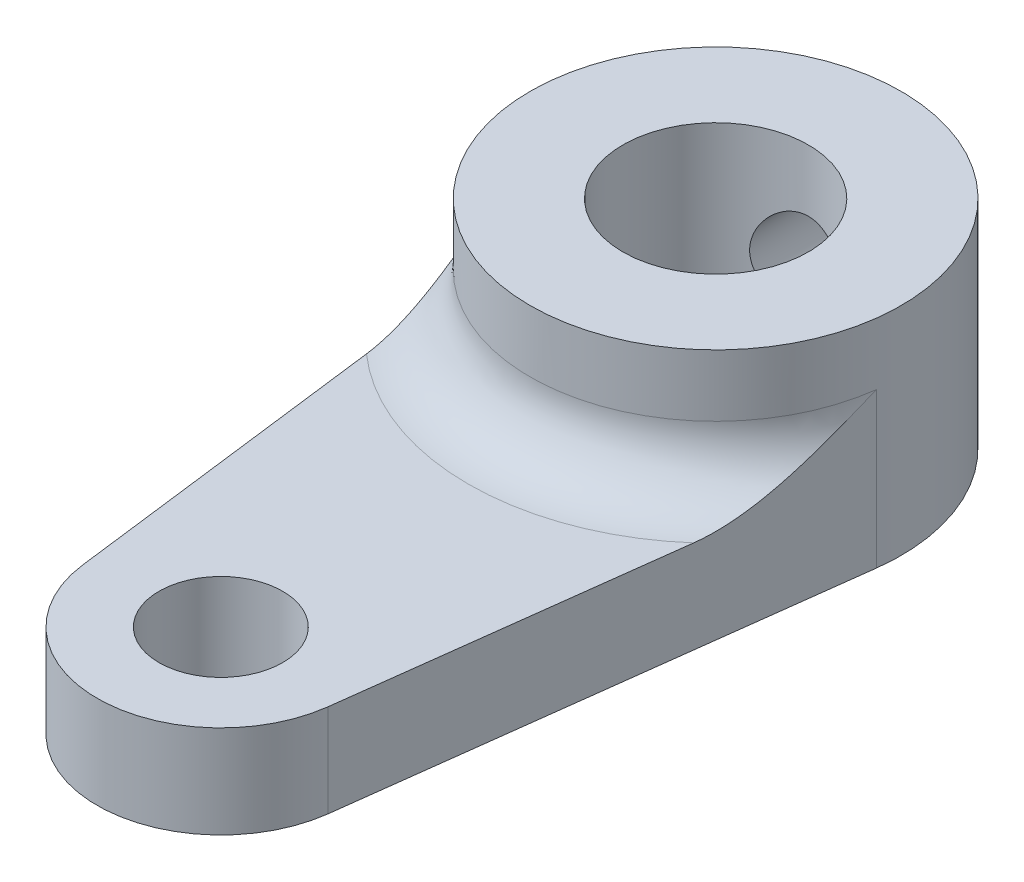
ISO-10303-21;
HEADER;
FILE_DESCRIPTION(('STEP AP214'),'2;1');
FILE_NAME('part.step','',(''),(''),'','','');
FILE_SCHEMA(('AUTOMOTIVE_DESIGN { 1 0 10303 214 1 1 1 1 }'));
ENDSEC;
DATA;
#1=APPLICATION_CONTEXT('core data for automotive mechanical design processes');
#2=APPLICATION_PROTOCOL_DEFINITION('international standard','automotive_design',2000,#1);
#3=PRODUCT_CONTEXT('',#1,'mechanical');
#4=PRODUCT('Part','Part','',(#3));
#5=PRODUCT_RELATED_PRODUCT_CATEGORY('part','',(#4));
#6=PRODUCT_DEFINITION_FORMATION('','',#4);
#7=PRODUCT_DEFINITION_CONTEXT('part definition',#1,'design');
#8=PRODUCT_DEFINITION('design','',#6,#7);
#9=PRODUCT_DEFINITION_SHAPE('','',#8);
#10=(LENGTH_UNIT() NAMED_UNIT(*) SI_UNIT(.MILLI.,.METRE.));
#11=(NAMED_UNIT(*) PLANE_ANGLE_UNIT() SI_UNIT($,.RADIAN.));
#12=(NAMED_UNIT(*) SI_UNIT($,.STERADIAN.) SOLID_ANGLE_UNIT());
#13=UNCERTAINTY_MEASURE_WITH_UNIT(LENGTH_MEASURE(1.E-05),#10,'distance_accuracy_value','');
#14=(GEOMETRIC_REPRESENTATION_CONTEXT(3) GLOBAL_UNCERTAINTY_ASSIGNED_CONTEXT((#13)) GLOBAL_UNIT_ASSIGNED_CONTEXT((#10,
#11,#12)) REPRESENTATION_CONTEXT('',''));
#15=CARTESIAN_POINT('',(0.,0.,0.));
#16=DIRECTION('',(0.,0.,1.));
#17=DIRECTION('',(1.,0.,0.));
#18=AXIS2_PLACEMENT_3D('',#15,#16,#17);
#19=CARTESIAN_POINT('',(-5.95294044989533,3.,0.750000000000001));
#20=DIRECTION('',(0.992156741649221,0.,-0.125));
#21=DIRECTION('',(-0.125,0.,-0.992156741649222));
#22=AXIS2_PLACEMENT_3D('',#19,#20,#21);
#23=PLANE('',#22);
#24=DIRECTION('',(0.125,0.,0.992156741649222));
#25=VECTOR('',#24,1.);
#26=CARTESIAN_POINT('',(-5.95294044989533,0.,0.750000000000001));
#27=LINE('',#26,#25);
#28=CARTESIAN_POINT('',(-5.95294044989533,0.,0.750000000000001));
#29=VERTEX_POINT('',#28);
#30=CARTESIAN_POINT('',(-3.96862696659688,0.,16.5));
#31=VERTEX_POINT('',#30);
#32=EDGE_CURVE('E177',#29,#31,#27,.T.);
#33=ORIENTED_EDGE('',*,*,#32,.T.);
#34=DIRECTION('',(0.,-1.,0.));
#35=VECTOR('',#34,1.);
#36=CARTESIAN_POINT('',(-3.96862696659688,3.,16.5));
#37=LINE('',#36,#35);
#38=CARTESIAN_POINT('',(-3.96862696659688,3.,16.5));
#39=VERTEX_POINT('',#38);
#40=EDGE_CURVE('E169',#39,#31,#37,.T.);
#41=ORIENTED_EDGE('',*,*,#40,.F.);
#42=DIRECTION('',(0.125,0.,0.992156741649222));
#43=VECTOR('',#42,1.);
#44=CARTESIAN_POINT('',(-5.95294044989533,3.,0.750000000000001));
#45=LINE('',#44,#43);
#46=CARTESIAN_POINT('',(-5.29150262212918,3.,6.));
#47=VERTEX_POINT('',#46);
#48=EDGE_CURVE('E153',#47,#39,#45,.T.);
#49=ORIENTED_EDGE('',*,*,#48,.F.);
#50=CARTESIAN_POINT('',(-5.29150262212918,3.,6.));
#51=CARTESIAN_POINT('',(-5.31039781985102,3.00003932371851,5.85002401756384));
#52=CARTESIAN_POINT('',(-5.32927068108454,3.00749080861605,5.7002253255075));
#53=CARTESIAN_POINT('',(-5.36682983971674,3.03529748814447,5.40210874592657));
#54=CARTESIAN_POINT('',(-5.38551644968368,3.05562506504879,5.25378837746843));
#55=CARTESIAN_POINT('',(-5.42237695613106,3.10690972129876,4.96121717768945));
#56=CARTESIAN_POINT('',(-5.44055436264542,3.13771036698746,4.81693848633806));
#57=CARTESIAN_POINT('',(-5.47663555915593,3.20848018103607,4.5305528674207));
#58=CARTESIAN_POINT('',(-5.49453918362414,3.24845467894679,4.38844725369198));
#59=CARTESIAN_POINT('',(-5.5510486235935,3.38804779430903,3.93991747903264));
#60=CARTESIAN_POINT('',(-5.589090545969,3.5022836971656,3.63796908103139));
#61=CARTESIAN_POINT('',(-5.66384180156038,3.75580816906779,3.04464938357758));
#62=CARTESIAN_POINT('',(-5.70054954085287,3.89512559194145,2.75329073549965));
#63=CARTESIAN_POINT('',(-5.8096367203732,4.33812108028087,1.88743809079078));
#64=CARTESIAN_POINT('',(-5.88048240155265,4.66533067276013,1.3251179291993));
#65=CARTESIAN_POINT('',(-5.95182241893325,4.99483605454589,0.758874095651225));
#66=CARTESIAN_POINT('',(-5.95238143594606,4.99741804396551,0.754437035667543));
#67=CARTESIAN_POINT('',(-5.95294044989533,5.,0.750000000000002));
#68=B_SPLINE_CURVE_WITH_KNOTS('',3,(#50,#51,#52,#53,#54,#55,#56,#57,#58,#59,#60,#61,#62,#63,#64,
#65,#66,#67),.UNSPECIFIED.,.F.,.F.,(4,2,2,2,2,2,2,2,4),(0.,0.453047985174248,0.905127510168364,
1.35073120961666,1.79659444088085,2.76988627914161,3.74430503334663,5.70583133706981,
5.72132327058452),.UNSPECIFIED.);
#69=CARTESIAN_POINT('',(-5.95294044989533,5.,0.750000000000001));
#70=VERTEX_POINT('',#69);
#71=EDGE_CURVE('E55',#47,#70,#68,.T.);
#72=ORIENTED_EDGE('',*,*,#71,.T.);
#73=DIRECTION('',(0.,-1.,0.));
#74=VECTOR('',#73,1.);
#75=CARTESIAN_POINT('',(-5.95294044989533,3.,0.750000000000001));
#76=LINE('',#75,#74);
#77=EDGE_CURVE('E355',#70,#29,#76,.T.);
#78=ORIENTED_EDGE('',*,*,#77,.T.);
#79=EDGE_LOOP('',(#33,#41,#49,#72,#78));
#80=FACE_BOUND('',#79,.T.);
#81=ADVANCED_FACE('F101',(#80),#23,.F.);
#82=CARTESIAN_POINT('',(0.,3.,16.));
#83=DIRECTION('',(0.,-1.,0.));
#84=DIRECTION('',(0.,0.,-1.));
#85=AXIS2_PLACEMENT_3D('',#82,#83,#84);
#86=CYLINDRICAL_SURFACE('',#85,4.);
#87=CARTESIAN_POINT('',(0.,0.,16.));
#88=DIRECTION('',(0.,1.,0.));
#89=DIRECTION('',(0.,0.,1.));
#90=AXIS2_PLACEMENT_3D('',#87,#88,#89);
#91=CIRCLE('',#90,4.);
#92=CARTESIAN_POINT('',(3.96862696659689,0.,16.5));
#93=VERTEX_POINT('',#92);
#94=EDGE_CURVE('E358',#31,#93,#91,.T.);
#95=ORIENTED_EDGE('',*,*,#94,.T.);
#96=DIRECTION('',(0.,-1.,0.));
#97=VECTOR('',#96,1.);
#98=CARTESIAN_POINT('',(3.96862696659689,3.,16.5));
#99=LINE('',#98,#97);
#100=CARTESIAN_POINT('',(3.96862696659689,3.,16.5));
#101=VERTEX_POINT('',#100);
#102=EDGE_CURVE('E171',#101,#93,#99,.T.);
#103=ORIENTED_EDGE('',*,*,#102,.F.);
#104=CARTESIAN_POINT('',(0.,3.,16.));
#105=DIRECTION('',(0.,1.,0.));
#106=DIRECTION('',(0.,0.,1.));
#107=AXIS2_PLACEMENT_3D('',#104,#105,#106);
#108=CIRCLE('',#107,4.);
#109=EDGE_CURVE('E157',#39,#101,#108,.T.);
#110=ORIENTED_EDGE('',*,*,#109,.F.);
#111=ORIENTED_EDGE('',*,*,#40,.T.);
#112=EDGE_LOOP('',(#95,#103,#110,#111));
#113=FACE_BOUND('',#112,.T.);
#114=ADVANCED_FACE('F168',(#113),#86,.T.);
#115=CARTESIAN_POINT('',(5.95294044989533,3.,0.75));
#116=DIRECTION('',(0.992156741649221,0.,0.125));
#117=DIRECTION('',(0.125,0.,-0.992156741649222));
#118=AXIS2_PLACEMENT_3D('',#115,#116,#117);
#119=PLANE('',#118);
#120=DIRECTION('',(-0.125,0.,0.992156741649222));
#121=VECTOR('',#120,1.);
#122=CARTESIAN_POINT('',(5.95294044989533,0.,0.75));
#123=LINE('',#122,#121);
#124=CARTESIAN_POINT('',(5.95294044989533,0.,0.75));
#125=VERTEX_POINT('',#124);
#126=EDGE_CURVE('E361',#125,#93,#123,.T.);
#127=ORIENTED_EDGE('',*,*,#126,.F.);
#128=DIRECTION('',(0.,-1.,0.));
#129=VECTOR('',#128,1.);
#130=CARTESIAN_POINT('',(5.95294044989533,3.,0.75));
#131=LINE('',#130,#129);
#132=CARTESIAN_POINT('',(5.95294044989533,5.,0.75));
#133=VERTEX_POINT('',#132);
#134=EDGE_CURVE('E185',#133,#125,#131,.T.);
#135=ORIENTED_EDGE('',*,*,#134,.F.);
#136=CARTESIAN_POINT('',(5.29150262212918,3.,6.));
#137=CARTESIAN_POINT('',(5.31039781985097,3.00003932371851,5.85002401756428));
#138=CARTESIAN_POINT('',(5.32927068108443,3.00749080861601,5.70022532550839));
#139=CARTESIAN_POINT('',(5.36682983971653,3.03529748814427,5.40210874592826));
#140=CARTESIAN_POINT('',(5.38551644968343,3.0556250650485,5.25378837747046));
#141=CARTESIAN_POINT('',(5.42237695613082,3.10690972129836,4.96121717769137));
#142=CARTESIAN_POINT('',(5.44055436264524,3.13771036698711,4.81693848633955));
#143=CARTESIAN_POINT('',(5.47663555915584,3.20848018103589,4.53055286742141));
#144=CARTESIAN_POINT('',(5.4945391836241,3.24845467894673,4.38844725369236));
#145=CARTESIAN_POINT('',(5.55104862359352,3.38804779430897,3.93991747903248));
#146=CARTESIAN_POINT('',(5.58909054596907,3.50228369716513,3.63796908103086));
#147=CARTESIAN_POINT('',(5.66384180156042,3.75580816906862,3.04464938357725));
#148=CARTESIAN_POINT('',(5.70054954085284,3.89512559194401,2.75329073549988));
#149=CARTESIAN_POINT('',(5.80963672037361,4.33812108027712,1.88743809078757));
#150=CARTESIAN_POINT('',(5.88048240155438,4.66533067273712,1.32511792918567));
#151=CARTESIAN_POINT('',(5.95182241893326,4.99483605454548,0.758874095651081));
#152=CARTESIAN_POINT('',(5.95238143594607,4.99741804396531,0.75443703566747));
#153=CARTESIAN_POINT('',(5.95294044989533,5.,0.75));
#154=B_SPLINE_CURVE_WITH_KNOTS('',3,(#136,#137,#138,#139,#140,#141,#142,#143,#144,#145,#146,
#147,#148,#149,#150,#151,#152,#153),.UNSPECIFIED.,.F.,.F.,(4,2,2,2,2,2,2,2,4),(0.,
0.45304798517289,0.905127510165945,1.35073120961554,1.79659444088085,2.76988627914195,
3.74430503334806,5.7058313370697,5.72132327058453),.UNSPECIFIED.);
#155=CARTESIAN_POINT('',(5.29150262212918,3.,6.));
#156=VERTEX_POINT('',#155);
#157=EDGE_CURVE('E117',#133,#156,#154,.F.);
#158=ORIENTED_EDGE('',*,*,#157,.T.);
#159=DIRECTION('',(-0.125,0.,0.992156741649222));
#160=VECTOR('',#159,1.);
#161=CARTESIAN_POINT('',(5.95294044989533,3.,0.75));
#162=LINE('',#161,#160);
#163=EDGE_CURVE('E173',#156,#101,#162,.T.);
#164=ORIENTED_EDGE('',*,*,#163,.T.);
#165=ORIENTED_EDGE('',*,*,#102,.T.);
#166=EDGE_LOOP('',(#127,#135,#158,#164,#165));
#167=FACE_BOUND('',#166,.T.);
#168=ADVANCED_FACE('F201',(#167),#119,.T.);
#169=CARTESIAN_POINT('',(0.,3.,0.));
#170=DIRECTION('',(0.,-1.,0.));
#171=DIRECTION('',(0.,0.,-1.));
#172=AXIS2_PLACEMENT_3D('',#169,#170,#171);
#173=CYLINDRICAL_SURFACE('',#172,3.);
#174=CARTESIAN_POINT('',(0.,5.,-3.));
#175=CARTESIAN_POINT('',(-0.0788579444268501,4.99999504652421,-2.99999570107562));
#176=CARTESIAN_POINT('',(-0.157809899546343,4.99374489031841,-2.99685736529635));
#177=CARTESIAN_POINT('',(-0.313380352903344,4.96902067948769,-2.98461234055736));
#178=CARTESIAN_POINT('',(-0.389994130070444,4.95052341050327,-2.97549431743379));
#179=CARTESIAN_POINT('',(-0.538400317320673,4.90220928707506,-2.95224419105063));
#180=CARTESIAN_POINT('',(-0.610210204408719,4.87243642362805,-2.93813158766306));
#181=CARTESIAN_POINT('',(-0.747708925209897,4.80264406795252,-2.90618664773642));
#182=CARTESIAN_POINT('',(-0.813398240985088,4.7626253836267,-2.88835460450288));
#183=CARTESIAN_POINT('',(-0.941261726642863,4.67072412577207,-2.84934387387093));
#184=CARTESIAN_POINT('',(-1.00298281668316,4.61827028114054,-2.82802798691306));
#185=CARTESIAN_POINT('',(-1.11716916730047,4.50421778112944,-2.78489955370115));
#186=CARTESIAN_POINT('',(-1.16962737466015,4.44261222234134,-2.76308664313552));
#187=CARTESIAN_POINT('',(-1.26787800067542,4.30627497571493,-2.71948426796021));
#188=CARTESIAN_POINT('',(-1.31283800332745,4.23089585248113,-2.69782780455198));
#189=CARTESIAN_POINT('',(-1.38925234033604,4.07244899602068,-2.65928968158481));
#190=CARTESIAN_POINT('',(-1.4207163224495,3.98938680691588,-2.64240461410485));
#191=CARTESIAN_POINT('',(-1.46719866328288,3.82300234186712,-2.61686800556713));
#192=CARTESIAN_POINT('',(-1.48308878562066,3.73999332189891,-2.6077840737557));
#193=CARTESIAN_POINT('',(-1.50064048996327,3.57203174333079,-2.59772834922792));
#194=CARTESIAN_POINT('',(-1.50231613255961,3.48708118869327,-2.59674854014932));
#195=CARTESIAN_POINT('',(-1.49203093075844,3.32857096352695,-2.60266395385873));
#196=CARTESIAN_POINT('',(-1.48167683930523,3.25486395316542,-2.6086314549302));
#197=CARTESIAN_POINT('',(-1.4504097735854,3.11041713594044,-2.62614343100776));
#198=CARTESIAN_POINT('',(-1.42949343584648,3.03967828204203,-2.63768968247665));
#199=CARTESIAN_POINT('',(-1.377314670579,2.90115630115151,-2.66531214619112));
#200=CARTESIAN_POINT('',(-1.34582260067399,2.83348040182132,-2.68148760995998));
#201=CARTESIAN_POINT('',(-1.273562531502,2.70404856111499,-2.71655106422106));
#202=CARTESIAN_POINT('',(-1.2327903657187,2.64229529659987,-2.73544027170286));
#203=CARTESIAN_POINT('',(-1.13709908236918,2.51821812088516,-2.77669736854929));
#204=CARTESIAN_POINT('',(-1.08104168755392,2.45681468963577,-2.79920265355119));
#205=CARTESIAN_POINT('',(-0.959333368112059,2.34389687211365,-2.84321434950611));
#206=CARTESIAN_POINT('',(-0.893677884861427,2.29238721194918,-2.86472027938201));
#207=CARTESIAN_POINT('',(-0.750774758747772,2.19847150845541,-2.90552980924446));
#208=CARTESIAN_POINT('',(-0.673130387399112,2.15659929133139,-2.92468476243011));
#209=CARTESIAN_POINT('',(-0.510699323233195,2.08685445643549,-2.95736821681863));
#210=CARTESIAN_POINT('',(-0.425918364397913,2.05897072247725,-2.9709011841533));
#211=CARTESIAN_POINT('',(-0.259149737491054,2.02028689442499,-2.98986500612153));
#212=CARTESIAN_POINT('',(-0.17751229582249,2.00826314637983,-2.99587407451965));
#213=CARTESIAN_POINT('',(-0.0131693999240281,1.99780290329827,-3.00109520188655));
#214=CARTESIAN_POINT('',(0.0695355298048626,1.9993599715408,-3.00031048081978));
#215=CARTESIAN_POINT('',(0.22684945797898,2.01531003262812,-2.99236788380152));
#216=CARTESIAN_POINT('',(0.301589112074894,2.02869879909499,-2.98570868532253));
#217=CARTESIAN_POINT('',(0.447610338452911,2.06635710784268,-2.9673325697226));
#218=CARTESIAN_POINT('',(0.518891528536629,2.09062784968024,-2.95561509501618));
#219=CARTESIAN_POINT('',(0.658332912674358,2.14999769964955,-2.92776377120382));
#220=CARTESIAN_POINT('',(0.726345595508704,2.18538657517443,-2.91151322654446));
#221=CARTESIAN_POINT('',(0.855692042548906,2.26566130346985,-2.87615961476126));
#222=CARTESIAN_POINT('',(0.917022944664886,2.31055120189309,-2.85705533350408));
#223=CARTESIAN_POINT('',(1.03765153393382,2.41364063799608,-2.81562332004297));
#224=CARTESIAN_POINT('',(1.09615811672854,2.47271430266772,-2.79316327265249));
#225=CARTESIAN_POINT('',(1.20278448167828,2.59988772691659,-2.7489358741323));
#226=CARTESIAN_POINT('',(1.25089707856781,2.66799367827188,-2.72716901100071));
#227=CARTESIAN_POINT('',(1.33756187171852,2.81546548125946,-2.68576788309734));
#228=CARTESIAN_POINT('',(1.37553824370037,2.89521689914172,-2.66628794383591));
#229=CARTESIAN_POINT('',(1.43712423890205,3.06126510136245,-2.63361108441202));
#230=CARTESIAN_POINT('',(1.46075237380052,3.14755328970034,-2.62040607332625));
#231=CARTESIAN_POINT('',(1.49079253120031,3.31536533432706,-2.60342251538703));
#232=CARTESIAN_POINT('',(1.49863949460818,3.39655138015286,-2.59886075197598));
#233=CARTESIAN_POINT('',(1.5010337315643,3.55917060074679,-2.59748031962405));
#234=CARTESIAN_POINT('',(1.49558676993486,3.64060365310679,-2.60065829439585));
#235=CARTESIAN_POINT('',(1.47288918838996,3.79322525230016,-2.61356793076615));
#236=CARTESIAN_POINT('',(1.45681247151455,3.86465070521711,-2.62264641723988));
#237=CARTESIAN_POINT('',(1.41476303733661,4.00371217913655,-2.64556524281479));
#238=CARTESIAN_POINT('',(1.38878713673988,4.07134697313805,-2.65940711354503));
#239=CARTESIAN_POINT('',(1.32572361795084,4.2059372764798,-2.69142795546804));
#240=CARTESIAN_POINT('',(1.28800670672355,4.27254185274354,-2.70983583593881));
#241=CARTESIAN_POINT('',(1.20322645745609,4.39891180427189,-2.74852997452291));
#242=CARTESIAN_POINT('',(1.15615825686234,4.45867359578167,-2.76881720693416));
#243=CARTESIAN_POINT('',(1.04730498999206,4.57721297353201,-2.81193484737138));
#244=CARTESIAN_POINT('',(0.984426634495891,4.63498865352543,-2.83477474959942));
#245=CARTESIAN_POINT('',(0.849232209349794,4.7393944751529,-2.87816628389896));
#246=CARTESIAN_POINT('',(0.776911084957794,4.78601860920486,-2.89871667939293));
#247=CARTESIAN_POINT('',(0.623897395174417,4.8668545440681,-2.93547014349806));
#248=CARTESIAN_POINT('',(0.543149255665094,4.9009762538547,-2.95164144740899));
#249=CARTESIAN_POINT('',(0.376113151707129,4.95471225163611,-2.9775201194848));
#250=CARTESIAN_POINT('',(0.289841699383649,4.97436777020857,-2.98724585044602));
#251=CARTESIAN_POINT('',(0.168902919736342,4.99084611662861,-2.99543192870217));
#252=CARTESIAN_POINT('',(0.135242819162347,4.99427396129951,-2.99714048010376));
#253=CARTESIAN_POINT('',(0.0677275977076368,4.99885199827112,-2.99942545465223));
#254=CARTESIAN_POINT('',(0.0338724714699424,5.00000212770531,-3.00000184655071));
#255=CARTESIAN_POINT('',(0.,5.,-3.));
#256=B_SPLINE_CURVE_WITH_KNOTS('',3,(#174,#175,#176,#177,#178,#179,#180,#181,#182,#183,#184,
#185,#186,#187,#188,#189,#190,#191,#192,#193,#194,#195,#196,#197,#198,#199,#200,#201,#202,#203,
#204,#205,#206,#207,#208,#209,#210,#211,#212,#213,#214,#215,#216,#217,#218,#219,#220,#221,#222,
#223,#224,#225,#226,#227,#228,#229,#230,#231,#232,#233,#234,#235,#236,#237,#238,#239,#240,#241,
#242,#243,#244,#245,#246,#247,#248,#249,#250,#251,#252,#253,#254,#255),.UNSPECIFIED.,.T.,.F.,(4,
2,2,2,2,2,2,2,2,2,2,2,2,2,2,2,2,2,2,2,2,2,2,2,2,2,2,2,2,2,2,2,2,2,2,2,2,2,2,2,4),(0.,
0.236436386130438,0.473322224563796,0.709293233238447,0.94524564087235,1.19547263807713,
1.44588935648105,1.71572589646129,1.98536921847421,2.23887018210344,2.4921203599353,
2.71508568613981,2.93812205888517,3.16635360252731,3.39468781890332,3.65197412000817,
3.90938301898029,4.1787453332166,4.44789325368419,4.69474935707018,4.94148846767213,
5.16910359759182,5.39674382446396,5.63089284041847,5.86514176122508,6.12239415966627,
6.37982382923147,6.64972023242588,6.91926767918175,7.16293961254569,7.40650589797016,
7.62686895373283,7.84730293182526,8.0825468517043,8.31791341715445,8.58187864135756,
8.84598575071867,9.11196020495289,9.37717362931723,9.47872920200874,9.58028757766598),.UNSPECIFIED.);
#257=CARTESIAN_POINT('',(0.,5.,-3.));
#258=VERTEX_POINT('',#257);
#259=EDGE_CURVE('E334',#258,#258,#256,.T.);
#260=ORIENTED_EDGE('',*,*,#259,.F.);
#261=EDGE_LOOP('',(#260));
#262=FACE_BOUND('',#261,.T.);
#263=CARTESIAN_POINT('',(0.,0.,0.));
#264=DIRECTION('',(0.,1.,0.));
#265=DIRECTION('',(0.,0.,1.));
#266=AXIS2_PLACEMENT_3D('',#263,#264,#265);
#267=CIRCLE('',#266,3.);
#268=CARTESIAN_POINT('',(0.,0.,3.));
#269=VERTEX_POINT('',#268);
#270=EDGE_CURVE('E368',#269,#269,#267,.T.);
#271=ORIENTED_EDGE('',*,*,#270,.F.);
#272=EDGE_LOOP('',(#271));
#273=FACE_BOUND('',#272,.T.);
#274=CARTESIAN_POINT('',(0.,7.,0.));
#275=DIRECTION('',(0.,1.,0.));
#276=DIRECTION('',(0.,0.,1.));
#277=AXIS2_PLACEMENT_3D('',#274,#275,#276);
#278=CIRCLE('',#277,3.);
#279=CARTESIAN_POINT('',(0.,7.,3.));
#280=VERTEX_POINT('',#279);
#281=EDGE_CURVE('E345',#280,#280,#278,.T.);
#282=ORIENTED_EDGE('',*,*,#281,.T.);
#283=EDGE_LOOP('',(#282));
#284=FACE_BOUND('',#283,.T.);
#285=ADVANCED_FACE('F205',(#262,#273,#284),#173,.F.);
#286=CARTESIAN_POINT('',(0.,3.,0.));
#287=DIRECTION('',(0.,-1.,0.));
#288=DIRECTION('',(0.,0.,-1.));
#289=AXIS2_PLACEMENT_3D('',#286,#287,#288);
#290=CYLINDRICAL_SURFACE('',#289,6.);
#291=CARTESIAN_POINT('',(0.,5.,-6.));
#292=CARTESIAN_POINT('',(-0.082876088669731,4.99999767426184,-5.99999859868013));
#293=CARTESIAN_POINT('',(-0.165778157830763,4.99310844922621,-5.99826578131828));
#294=CARTESIAN_POINT('',(-0.329206323770532,4.96577484869299,-5.99152113829892));
#295=CARTESIAN_POINT('',(-0.409731046870739,4.94532279046215,-5.98650745419968));
#296=CARTESIAN_POINT('',(-0.566020872182576,4.89156074653791,-5.9737562633204));
#297=CARTESIAN_POINT('',(-0.641791563430002,4.85826620128472,-5.96602202842087));
#298=CARTESIAN_POINT('',(-0.786672131904425,4.77981860995516,-5.94865343807593));
#299=CARTESIAN_POINT('',(-0.855781784348758,4.73466516388106,-5.9390190185405));
#300=CARTESIAN_POINT('',(-0.986801927300918,4.63279921034579,-5.91867413591801));
#301=CARTESIAN_POINT('',(-1.04855569006107,4.57588842504082,-5.90794707148533));
#302=CARTESIAN_POINT('',(-1.1617489272033,4.45254779509108,-5.8867362011753));
#303=CARTESIAN_POINT('',(-1.21318723694913,4.3861168770535,-5.87625242288349));
#304=CARTESIAN_POINT('',(-1.30502654279903,4.24440477326256,-5.8565477569971));
#305=CARTESIAN_POINT('',(-1.34525221592535,4.1690067691896,-5.84734794470605));
#306=CARTESIAN_POINT('',(-1.41239690855053,4.01225158834164,-5.83149494812223));
#307=CARTESIAN_POINT('',(-1.43931805543933,3.93089536667424,-5.82484135672789));
#308=CARTESIAN_POINT('',(-1.47855483680429,3.76625650179753,-5.81500476717551));
#309=CARTESIAN_POINT('',(-1.49115226833334,3.6830451039502,-5.81175491075426));
#310=CARTESIAN_POINT('',(-1.50226177506785,3.51563143098602,-5.80889362537741));
#311=CARTESIAN_POINT('',(-1.50077614181798,3.43142931930139,-5.80928160448644));
#312=CARTESIAN_POINT('',(-1.48398652463928,3.26658419225552,-5.81359205496618));
#313=CARTESIAN_POINT('',(-1.46901834019052,3.1859043785349,-5.81742863001879));
#314=CARTESIAN_POINT('',(-1.4262241869031,3.02823894908871,-5.82806709676484));
#315=CARTESIAN_POINT('',(-1.39839730206942,2.95125359697102,-5.83486919970697));
#316=CARTESIAN_POINT('',(-1.33038947793715,2.80226198374794,-5.85075113904187));
#317=CARTESIAN_POINT('',(-1.29008666723291,2.73031382821045,-5.85985327469421));
#318=CARTESIAN_POINT('',(-1.19835627601495,2.59408129024316,-5.87929710846386));
#319=CARTESIAN_POINT('',(-1.14692674880884,2.52979825193275,-5.88963902334735));
#320=CARTESIAN_POINT('',(-1.03266342468122,2.4087963843056,-5.91075880539781));
#321=CARTESIAN_POINT('',(-0.969546258165859,2.35234550993865,-5.92154069477971));
#322=CARTESIAN_POINT('',(-0.834611917503699,2.2507787575361,-5.94205965578786));
#323=CARTESIAN_POINT('',(-0.762794477707943,2.20566322573644,-5.95179669549415));
#324=CARTESIAN_POINT('',(-0.612115888681391,2.12794941377562,-5.96917732094183));
#325=CARTESIAN_POINT('',(-0.533231393208623,2.09539465974557,-5.97681360127725));
#326=CARTESIAN_POINT('',(-0.370876008142883,2.04408269429043,-5.98907916991419));
#327=CARTESIAN_POINT('',(-0.287405999150485,2.02532284358186,-5.99370903339281));
#328=CARTESIAN_POINT('',(-0.120539970390027,2.00254243444116,-5.99935499271375));
#329=CARTESIAN_POINT('',(-0.0371967199882101,1.9981569739247,-6.00046053508279));
#330=CARTESIAN_POINT('',(0.129032874801508,2.00324900205549,-5.99918804814451));
#331=CARTESIAN_POINT('',(0.211919259644594,2.01272524279914,-5.99681033241847));
#332=CARTESIAN_POINT('',(0.373614268776491,2.04497090839138,-5.98889581127357));
#333=CARTESIAN_POINT('',(0.452465118968754,2.06754126347699,-5.98340634185811));
#334=CARTESIAN_POINT('',(0.605257292452511,2.12510708402845,-5.96988706634134));
#335=CARTESIAN_POINT('',(0.679198119032634,2.16010380431317,-5.96185700369892));
#336=CARTESIAN_POINT('',(0.821523134429846,2.24223612887473,-5.9439330792631));
#337=CARTESIAN_POINT('',(0.889785441835829,2.28957611239676,-5.93400867366932));
#338=CARTESIAN_POINT('',(1.01752661364324,2.39478990879697,-5.91344509187419));
#339=CARTESIAN_POINT('',(1.07700395897301,2.45266553961691,-5.90280579251705));
#340=CARTESIAN_POINT('',(1.18699056807273,2.57900196084447,-5.88168956960771));
#341=CARTESIAN_POINT('',(1.23724386762203,2.64768770300242,-5.87122304187281));
#342=CARTESIAN_POINT('',(1.3255107590127,2.79273263446572,-5.85192878377239));
#343=CARTESIAN_POINT('',(1.36352489415793,2.86909148295975,-5.84310098067026));
#344=CARTESIAN_POINT('',(1.42595142060929,3.02690572241308,-5.82818094734665));
#345=CARTESIAN_POINT('',(1.45044439665406,3.10832762834401,-5.82207255291906));
#346=CARTESIAN_POINT('',(1.48534565995378,3.27430963788911,-5.81326744090184));
#347=CARTESIAN_POINT('',(1.49575702747866,3.35886905103249,-5.81056997719936));
#348=CARTESIAN_POINT('',(1.50203859033399,3.5261210238552,-5.80894901203957));
#349=CARTESIAN_POINT('',(1.49831789778012,3.60879743512473,-5.80991932728264));
#350=CARTESIAN_POINT('',(1.47737727831287,3.77230388866798,-5.81527909007843));
#351=CARTESIAN_POINT('',(1.46015762268677,3.85313396801365,-5.81966846891857));
#352=CARTESIAN_POINT('',(1.41293131944279,4.01020845906541,-5.83131260682723));
#353=CARTESIAN_POINT('',(1.38300140468037,4.08647730524021,-5.8385501523631));
#354=CARTESIAN_POINT('',(1.31126491360507,4.23296538271369,-5.85507755724829));
#355=CARTESIAN_POINT('',(1.26945669003419,4.30318377318692,-5.86436770120773));
#356=CARTESIAN_POINT('',(1.17386774863713,4.43755462900202,-5.88425634263512));
#357=CARTESIAN_POINT('',(1.11980316291225,4.50150107342396,-5.89488264831757));
#358=CARTESIAN_POINT('',(1.00178937118973,4.61954704479541,-5.91608027246286));
#359=CARTESIAN_POINT('',(0.937837821261145,4.67364423011297,-5.9266515772706));
#360=CARTESIAN_POINT('',(0.800467586702589,4.77141130856461,-5.94677655647663));
#361=CARTESIAN_POINT('',(0.726898422316385,4.81487461367158,-5.95630833365868));
#362=CARTESIAN_POINT('',(0.573266059510475,4.88874746294053,-5.97304924975118));
#363=CARTESIAN_POINT('',(0.493207563436739,4.91916636064853,-5.98026005199781));
#364=CARTESIAN_POINT('',(0.344410253243471,4.96157183032965,-5.99048059565542));
#365=CARTESIAN_POINT('',(0.276380170908068,4.97595124305343,-5.99402585052691));
#366=CARTESIAN_POINT('',(0.138906071536283,4.99516594362194,-5.99878605231948));
#367=CARTESIAN_POINT('',(0.0694621612426162,5.0000019493053,-6.00000117450894));
#368=CARTESIAN_POINT('',(0.,5.,-6.));
#369=B_SPLINE_CURVE_WITH_KNOTS('',3,(#291,#292,#293,#294,#295,#296,#297,#298,#299,#300,#301,
#302,#303,#304,#305,#306,#307,#308,#309,#310,#311,#312,#313,#314,#315,#316,#317,#318,#319,#320,
#321,#322,#323,#324,#325,#326,#327,#328,#329,#330,#331,#332,#333,#334,#335,#336,#337,#338,#339,
#340,#341,#342,#343,#344,#345,#346,#347,#348,#349,#350,#351,#352,#353,#354,#355,#356,#357,#358,
#359,#360,#361,#362,#363,#364,#365,#366,#367,#368),.UNSPECIFIED.,.T.,.F.,(4,2,2,2,2,2,2,2,2,2,2,
2,2,2,2,2,2,2,2,2,2,2,2,2,2,2,2,2,2,2,2,2,2,2,2,2,2,2,4),(0.,0.248373712471889,
0.496888237763899,0.745104902286105,0.993329940169327,1.24614435437139,1.49898729580062,
1.75558647545807,2.01214461169368,2.2635629509943,2.51494038112696,2.76022497007018,
3.00552703466038,3.25330527873879,3.50112690836162,3.75601500969019,4.01091089558247,
4.26668229009113,4.52240473688642,4.77158308949276,5.02073901112742,5.26620274514037,
5.5116912732229,5.76153587565351,6.01142363008018,6.26744509204475,6.52345518749507,
6.77792254614035,7.03233423252407,7.27943780398611,7.52653640956033,7.77216400559446,
8.017825681369,8.26989576409909,8.52202569770416,8.77872185499587,9.03523363821349,
9.24342242942148,9.45159556043038),.UNSPECIFIED.);
#370=CARTESIAN_POINT('',(0.,5.,-6.));
#371=VERTEX_POINT('',#370);
#372=EDGE_CURVE('E106',#371,#371,#369,.T.);
#373=ORIENTED_EDGE('',*,*,#372,.T.);
#374=EDGE_LOOP('',(#373));
#375=FACE_BOUND('',#374,.T.);
#376=CARTESIAN_POINT('',(0.,5.,0.));
#377=DIRECTION('',(0.,1.,0.));
#378=DIRECTION('',(0.,0.,1.));
#379=AXIS2_PLACEMENT_3D('',#376,#377,#378);
#380=CIRCLE('',#379,6.);
#381=EDGE_CURVE('E179',#70,#133,#380,.T.);
#382=ORIENTED_EDGE('',*,*,#381,.T.);
#383=ORIENTED_EDGE('',*,*,#134,.T.);
#384=CARTESIAN_POINT('',(0.,0.,0.));
#385=DIRECTION('',(0.,1.,0.));
#386=DIRECTION('',(0.,0.,1.));
#387=AXIS2_PLACEMENT_3D('',#384,#385,#386);
#388=CIRCLE('',#387,6.);
#389=EDGE_CURVE('E365',#125,#29,#388,.T.);
#390=ORIENTED_EDGE('',*,*,#389,.T.);
#391=ORIENTED_EDGE('',*,*,#77,.F.);
#392=EDGE_LOOP('',(#382,#383,#390,#391));
#393=FACE_BOUND('',#392,.T.);
#394=CARTESIAN_POINT('',(0.,7.,0.));
#395=DIRECTION('',(0.,1.,0.));
#396=DIRECTION('',(0.,0.,1.));
#397=AXIS2_PLACEMENT_3D('',#394,#395,#396);
#398=CIRCLE('',#397,6.);
#399=CARTESIAN_POINT('',(0.,7.,6.));
#400=VERTEX_POINT('',#399);
#401=EDGE_CURVE('E340',#400,#400,#398,.T.);
#402=ORIENTED_EDGE('',*,*,#401,.F.);
#403=EDGE_LOOP('',(#402));
#404=FACE_BOUND('',#403,.T.);
#405=ADVANCED_FACE('F206',(#375,#393,#404),#290,.T.);
#406=CARTESIAN_POINT('',(0.,3.,16.));
#407=DIRECTION('',(0.,-1.,0.));
#408=DIRECTION('',(0.,0.,-1.));
#409=AXIS2_PLACEMENT_3D('',#406,#407,#408);
#410=CYLINDRICAL_SURFACE('',#409,2.);
#411=CARTESIAN_POINT('',(0.,3.,16.));
#412=DIRECTION('',(0.,1.,0.));
#413=DIRECTION('',(0.,0.,1.));
#414=AXIS2_PLACEMENT_3D('',#411,#412,#413);
#415=CIRCLE('',#414,2.);
#416=CARTESIAN_POINT('',(0.,3.,18.));
#417=VERTEX_POINT('',#416);
#418=EDGE_CURVE('E351',#417,#417,#415,.T.);
#419=ORIENTED_EDGE('',*,*,#418,.T.);
#420=EDGE_LOOP('',(#419));
#421=FACE_BOUND('',#420,.T.);
#422=CARTESIAN_POINT('',(0.,0.,16.));
#423=DIRECTION('',(0.,1.,0.));
#424=DIRECTION('',(0.,0.,1.));
#425=AXIS2_PLACEMENT_3D('',#422,#423,#424);
#426=CIRCLE('',#425,2.);
#427=CARTESIAN_POINT('',(0.,0.,18.));
#428=VERTEX_POINT('',#427);
#429=EDGE_CURVE('E163',#428,#428,#426,.T.);
#430=ORIENTED_EDGE('',*,*,#429,.F.);
#431=EDGE_LOOP('',(#430));
#432=FACE_BOUND('',#431,.T.);
#433=ADVANCED_FACE('F238',(#421,#432),#410,.F.);
#434=CARTESIAN_POINT('',(0.,3.,0.));
#435=DIRECTION('',(0.,1.,0.));
#436=DIRECTION('',(0.,0.,1.));
#437=AXIS2_PLACEMENT_3D('',#434,#435,#436);
#438=PLANE('',#437);
#439=ORIENTED_EDGE('',*,*,#163,.F.);
#440=CARTESIAN_POINT('',(0.,3.,0.));
#441=DIRECTION('',(0.,1.,0.));
#442=DIRECTION('',(0.,0.,1.));
#443=AXIS2_PLACEMENT_3D('',#440,#441,#442);
#444=CIRCLE('',#443,8.);
#445=EDGE_CURVE('E130',#156,#47,#444,.F.);
#446=ORIENTED_EDGE('',*,*,#445,.T.);
#447=ORIENTED_EDGE('',*,*,#48,.T.);
#448=ORIENTED_EDGE('',*,*,#109,.T.);
#449=EDGE_LOOP('',(#439,#446,#447,#448));
#450=FACE_BOUND('',#449,.T.);
#451=ORIENTED_EDGE('',*,*,#418,.F.);
#452=EDGE_LOOP('',(#451));
#453=FACE_BOUND('',#452,.T.);
#454=ADVANCED_FACE('F155',(#450,#453),#438,.T.);
#455=CARTESIAN_POINT('',(0.,0.,0.));
#456=DIRECTION('',(0.,1.,0.));
#457=DIRECTION('',(0.,0.,1.));
#458=AXIS2_PLACEMENT_3D('',#455,#456,#457);
#459=PLANE('',#458);
#460=ORIENTED_EDGE('',*,*,#32,.F.);
#461=ORIENTED_EDGE('',*,*,#389,.F.);
#462=ORIENTED_EDGE('',*,*,#126,.T.);
#463=ORIENTED_EDGE('',*,*,#94,.F.);
#464=EDGE_LOOP('',(#460,#461,#462,#463));
#465=FACE_BOUND('',#464,.T.);
#466=ORIENTED_EDGE('',*,*,#270,.T.);
#467=EDGE_LOOP('',(#466));
#468=FACE_BOUND('',#467,.T.);
#469=ORIENTED_EDGE('',*,*,#429,.T.);
#470=EDGE_LOOP('',(#469));
#471=FACE_BOUND('',#470,.T.);
#472=ADVANCED_FACE('F252',(#465,#468,#471),#459,.F.);
#473=CARTESIAN_POINT('',(0.,7.,0.));
#474=DIRECTION('',(0.,1.,0.));
#475=DIRECTION('',(0.,0.,1.));
#476=AXIS2_PLACEMENT_3D('',#473,#474,#475);
#477=PLANE('',#476);
#478=ORIENTED_EDGE('',*,*,#401,.T.);
#479=EDGE_LOOP('',(#478));
#480=FACE_BOUND('',#479,.T.);
#481=ORIENTED_EDGE('',*,*,#281,.F.);
#482=EDGE_LOOP('',(#481));
#483=FACE_BOUND('',#482,.T.);
#484=ADVANCED_FACE('F258',(#480,#483),#477,.T.);
#485=CARTESIAN_POINT('',(0.,5.,0.));
#486=DIRECTION('',(0.,1.,0.));
#487=DIRECTION('',(0.,0.,1.));
#488=AXIS2_PLACEMENT_3D('',#485,#486,#487);
#489=TOROIDAL_SURFACE('',#488,8.,2.);
#490=ORIENTED_EDGE('',*,*,#71,.F.);
#491=ORIENTED_EDGE('',*,*,#445,.F.);
#492=ORIENTED_EDGE('',*,*,#157,.F.);
#493=ORIENTED_EDGE('',*,*,#381,.F.);
#494=EDGE_LOOP('',(#490,#491,#492,#493));
#495=FACE_BOUND('',#494,.T.);
#496=ADVANCED_FACE('F103',(#495),#489,.F.);
#497=CARTESIAN_POINT('',(0.,3.5,-7.));
#498=DIRECTION('',(0.,0.,-1.));
#499=DIRECTION('',(-1.,0.,0.));
#500=AXIS2_PLACEMENT_3D('',#497,#498,#499);
#501=CYLINDRICAL_SURFACE('',#500,1.5);
#502=ORIENTED_EDGE('',*,*,#259,.T.);
#503=EDGE_LOOP('',(#502));
#504=FACE_BOUND('',#503,.T.);
#505=ORIENTED_EDGE('',*,*,#372,.F.);
#506=EDGE_LOOP('',(#505));
#507=FACE_BOUND('',#506,.T.);
#508=ADVANCED_FACE('F271',(#504,#507),#501,.F.);
#509=CLOSED_SHELL('',(#81,#114,#168,#285,#405,#433,#454,#472,#484,#496,#508));
#510=MANIFOLD_SOLID_BREP('B6',#509);
#511=ADVANCED_BREP_SHAPE_REPRESENTATION('',(#18,#510),#14);
#512=SHAPE_DEFINITION_REPRESENTATION(#9,#511);
ENDSEC;
END-ISO-10303-21;
